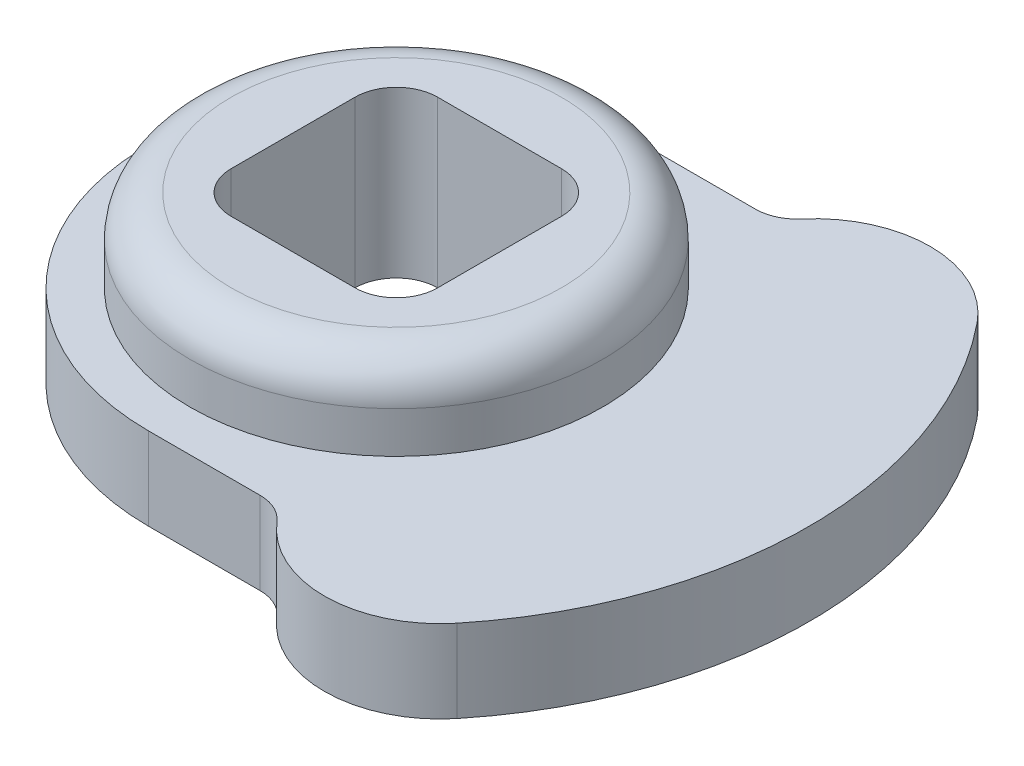
ISO-10303-21;
HEADER;
FILE_DESCRIPTION(('STEP AP214'),'2;1');
FILE_NAME('part.step','',(''),(''),'','','');
FILE_SCHEMA(('AUTOMOTIVE_DESIGN { 1 0 10303 214 1 1 1 1 }'));
ENDSEC;
DATA;
#1=APPLICATION_CONTEXT('core data for automotive mechanical design processes');
#2=APPLICATION_PROTOCOL_DEFINITION('international standard','automotive_design',2000,#1);
#3=PRODUCT_CONTEXT('',#1,'mechanical');
#4=PRODUCT('Part','Part','',(#3));
#5=PRODUCT_RELATED_PRODUCT_CATEGORY('part','',(#4));
#6=PRODUCT_DEFINITION_FORMATION('','',#4);
#7=PRODUCT_DEFINITION_CONTEXT('part definition',#1,'design');
#8=PRODUCT_DEFINITION('design','',#6,#7);
#9=PRODUCT_DEFINITION_SHAPE('','',#8);
#10=(LENGTH_UNIT() NAMED_UNIT(*) SI_UNIT(.MILLI.,.METRE.));
#11=(NAMED_UNIT(*) PLANE_ANGLE_UNIT() SI_UNIT($,.RADIAN.));
#12=(NAMED_UNIT(*) SI_UNIT($,.STERADIAN.) SOLID_ANGLE_UNIT());
#13=UNCERTAINTY_MEASURE_WITH_UNIT(LENGTH_MEASURE(1.E-05),#10,'distance_accuracy_value','');
#14=(GEOMETRIC_REPRESENTATION_CONTEXT(3) GLOBAL_UNCERTAINTY_ASSIGNED_CONTEXT((#13)) GLOBAL_UNIT_ASSIGNED_CONTEXT((#10,
#11,#12)) REPRESENTATION_CONTEXT('',''));
#15=CARTESIAN_POINT('',(0.,0.,0.));
#16=DIRECTION('',(0.,0.,1.));
#17=DIRECTION('',(1.,0.,0.));
#18=AXIS2_PLACEMENT_3D('',#15,#16,#17);
#19=CARTESIAN_POINT('',(0.,5.08,0.));
#20=DIRECTION('',(0.,-1.,0.));
#21=DIRECTION('',(0.,0.,-1.));
#22=AXIS2_PLACEMENT_3D('',#19,#20,#21);
#23=CYLINDRICAL_SURFACE('',#22,6.35);
#24=CARTESIAN_POINT('',(0.,3.81,0.));
#25=DIRECTION('',(0.,1.,0.));
#26=DIRECTION('',(0.,0.,1.));
#27=AXIS2_PLACEMENT_3D('',#24,#25,#26);
#28=CIRCLE('',#27,6.35);
#29=CARTESIAN_POINT('',(0.,3.81,6.35));
#30=VERTEX_POINT('',#29);
#31=EDGE_CURVE('E11',#30,#30,#28,.F.);
#32=ORIENTED_EDGE('',*,*,#31,.T.);
#33=EDGE_LOOP('',(#32));
#34=FACE_BOUND('',#33,.T.);
#35=CARTESIAN_POINT('',(0.,2.54,0.));
#36=DIRECTION('',(0.,1.,0.));
#37=DIRECTION('',(0.,0.,1.));
#38=AXIS2_PLACEMENT_3D('',#35,#36,#37);
#39=CIRCLE('',#38,6.35);
#40=CARTESIAN_POINT('',(0.,2.54,6.35));
#41=VERTEX_POINT('',#40);
#42=EDGE_CURVE('E272',#41,#41,#39,.T.);
#43=ORIENTED_EDGE('',*,*,#42,.T.);
#44=EDGE_LOOP('',(#43));
#45=FACE_BOUND('',#44,.T.);
#46=ADVANCED_FACE('F33',(#34,#45),#23,.T.);
#47=CARTESIAN_POINT('',(0.,5.08,0.));
#48=DIRECTION('',(0.,1.,0.));
#49=DIRECTION('',(0.,0.,1.));
#50=AXIS2_PLACEMENT_3D('',#47,#48,#49);
#51=PLANE('',#50);
#52=CARTESIAN_POINT('',(0.,5.08,0.));
#53=DIRECTION('',(0.,1.,0.));
#54=DIRECTION('',(0.,0.,1.));
#55=AXIS2_PLACEMENT_3D('',#52,#53,#54);
#56=CIRCLE('',#55,5.08);
#57=CARTESIAN_POINT('',(0.,5.08,5.08));
#58=VERTEX_POINT('',#57);
#59=EDGE_CURVE('E41',#58,#58,#56,.T.);
#60=ORIENTED_EDGE('',*,*,#59,.T.);
#61=EDGE_LOOP('',(#60));
#62=FACE_BOUND('',#61,.T.);
#63=CARTESIAN_POINT('',(-1.905,5.08,1.905));
#64=DIRECTION('',(0.,1.,0.));
#65=DIRECTION('',(0.,0.,1.));
#66=AXIS2_PLACEMENT_3D('',#63,#64,#65);
#67=CIRCLE('',#66,1.27);
#68=CARTESIAN_POINT('',(-3.175,5.08,1.90499999999999));
#69=VERTEX_POINT('',#68);
#70=CARTESIAN_POINT('',(-1.90499999999999,5.08,3.175));
#71=VERTEX_POINT('',#70);
#72=EDGE_CURVE('E48',#69,#71,#67,.T.);
#73=ORIENTED_EDGE('',*,*,#72,.F.);
#74=DIRECTION('',(0.,0.,1.));
#75=VECTOR('',#74,1.);
#76=CARTESIAN_POINT('',(-3.175,5.08,-1.90499999999999));
#77=LINE('',#76,#75);
#78=CARTESIAN_POINT('',(-3.175,5.08,-1.90499999999999));
#79=VERTEX_POINT('',#78);
#80=EDGE_CURVE('E165',#79,#69,#77,.T.);
#81=ORIENTED_EDGE('',*,*,#80,.F.);
#82=CARTESIAN_POINT('',(-1.905,5.08,-1.905));
#83=DIRECTION('',(0.,1.,0.));
#84=DIRECTION('',(0.,0.,1.));
#85=AXIS2_PLACEMENT_3D('',#82,#83,#84);
#86=CIRCLE('',#85,1.27);
#87=CARTESIAN_POINT('',(-1.90499999999999,5.08,-3.175));
#88=VERTEX_POINT('',#87);
#89=EDGE_CURVE('E168',#88,#79,#86,.T.);
#90=ORIENTED_EDGE('',*,*,#89,.F.);
#91=DIRECTION('',(-1.,0.,0.));
#92=VECTOR('',#91,1.);
#93=CARTESIAN_POINT('',(-1.90499999999999,5.08,-3.175));
#94=LINE('',#93,#92);
#95=CARTESIAN_POINT('',(1.90499999999999,5.08,-3.175));
#96=VERTEX_POINT('',#95);
#97=EDGE_CURVE('E196',#96,#88,#94,.T.);
#98=ORIENTED_EDGE('',*,*,#97,.F.);
#99=CARTESIAN_POINT('',(1.905,5.08,-1.905));
#100=DIRECTION('',(0.,1.,0.));
#101=DIRECTION('',(0.,0.,1.));
#102=AXIS2_PLACEMENT_3D('',#99,#100,#101);
#103=CIRCLE('',#102,1.27);
#104=CARTESIAN_POINT('',(3.175,5.08,-1.90499999999999));
#105=VERTEX_POINT('',#104);
#106=EDGE_CURVE('E193',#105,#96,#103,.T.);
#107=ORIENTED_EDGE('',*,*,#106,.F.);
#108=DIRECTION('',(0.,0.,-1.));
#109=VECTOR('',#108,1.);
#110=CARTESIAN_POINT('',(3.175,5.08,-1.90499999999999));
#111=LINE('',#110,#109);
#112=CARTESIAN_POINT('',(3.175,5.08,1.90499999999999));
#113=VERTEX_POINT('',#112);
#114=EDGE_CURVE('E190',#113,#105,#111,.T.);
#115=ORIENTED_EDGE('',*,*,#114,.F.);
#116=CARTESIAN_POINT('',(1.905,5.08,1.905));
#117=DIRECTION('',(0.,1.,0.));
#118=DIRECTION('',(0.,0.,1.));
#119=AXIS2_PLACEMENT_3D('',#116,#117,#118);
#120=CIRCLE('',#119,1.27);
#121=CARTESIAN_POINT('',(1.90499999999999,5.08,3.175));
#122=VERTEX_POINT('',#121);
#123=EDGE_CURVE('E187',#122,#113,#120,.T.);
#124=ORIENTED_EDGE('',*,*,#123,.F.);
#125=DIRECTION('',(1.,0.,0.));
#126=VECTOR('',#125,1.);
#127=CARTESIAN_POINT('',(-1.90499999999999,5.08,3.175));
#128=LINE('',#127,#126);
#129=EDGE_CURVE('E185',#71,#122,#128,.T.);
#130=ORIENTED_EDGE('',*,*,#129,.F.);
#131=EDGE_LOOP('',(#73,#81,#90,#98,#107,#115,#124,#130));
#132=FACE_BOUND('',#131,.T.);
#133=ADVANCED_FACE('F277',(#62,#132),#51,.T.);
#134=CARTESIAN_POINT('',(0.,2.54,0.));
#135=DIRECTION('',(0.,-1.,0.));
#136=DIRECTION('',(0.,0.,-1.));
#137=AXIS2_PLACEMENT_3D('',#134,#135,#136);
#138=CYLINDRICAL_SURFACE('',#137,7.62);
#139=CARTESIAN_POINT('',(0.,0.,0.));
#140=DIRECTION('',(0.,1.,0.));
#141=DIRECTION('',(0.,0.,1.));
#142=AXIS2_PLACEMENT_3D('',#139,#140,#141);
#143=CIRCLE('',#142,7.62);
#144=CARTESIAN_POINT('',(0.,0.,-7.62));
#145=VERTEX_POINT('',#144);
#146=CARTESIAN_POINT('',(0.,0.,7.62));
#147=VERTEX_POINT('',#146);
#148=EDGE_CURVE('E203',#145,#147,#143,.T.);
#149=ORIENTED_EDGE('',*,*,#148,.T.);
#150=DIRECTION('',(0.,-1.,0.));
#151=VECTOR('',#150,1.);
#152=CARTESIAN_POINT('',(0.,2.54,7.62));
#153=LINE('',#152,#151);
#154=CARTESIAN_POINT('',(0.,2.54,7.62));
#155=VERTEX_POINT('',#154);
#156=EDGE_CURVE('E269',#155,#147,#153,.T.);
#157=ORIENTED_EDGE('',*,*,#156,.F.);
#158=CARTESIAN_POINT('',(0.,2.54,0.));
#159=DIRECTION('',(0.,1.,0.));
#160=DIRECTION('',(0.,0.,1.));
#161=AXIS2_PLACEMENT_3D('',#158,#159,#160);
#162=CIRCLE('',#161,7.62);
#163=CARTESIAN_POINT('',(0.,2.54,-7.62));
#164=VERTEX_POINT('',#163);
#165=EDGE_CURVE('E215',#164,#155,#162,.T.);
#166=ORIENTED_EDGE('',*,*,#165,.F.);
#167=DIRECTION('',(0.,-1.,0.));
#168=VECTOR('',#167,1.);
#169=CARTESIAN_POINT('',(0.,2.54,-7.62));
#170=LINE('',#169,#168);
#171=EDGE_CURVE('E233',#164,#145,#170,.T.);
#172=ORIENTED_EDGE('',*,*,#171,.T.);
#173=EDGE_LOOP('',(#149,#157,#166,#172));
#174=FACE_BOUND('',#173,.T.);
#175=ADVANCED_FACE('F293',(#174),#138,.T.);
#176=CARTESIAN_POINT('',(0.,2.54,7.62));
#177=DIRECTION('',(0.,0.,-1.));
#178=DIRECTION('',(-1.,0.,0.));
#179=AXIS2_PLACEMENT_3D('',#176,#177,#178);
#180=PLANE('',#179);
#181=DIRECTION('',(1.,0.,0.));
#182=VECTOR('',#181,1.);
#183=CARTESIAN_POINT('',(0.,0.,7.62));
#184=LINE('',#183,#182);
#185=CARTESIAN_POINT('',(3.429,0.,7.62));
#186=VERTEX_POINT('',#185);
#187=EDGE_CURVE('E236',#147,#186,#184,.T.);
#188=ORIENTED_EDGE('',*,*,#187,.T.);
#189=DIRECTION('',(0.,-1.,0.));
#190=VECTOR('',#189,1.);
#191=CARTESIAN_POINT('',(3.429,2.54,7.62));
#192=LINE('',#191,#190);
#193=CARTESIAN_POINT('',(3.429,2.54,7.62));
#194=VERTEX_POINT('',#193);
#195=EDGE_CURVE('E266',#194,#186,#192,.T.);
#196=ORIENTED_EDGE('',*,*,#195,.F.);
#197=DIRECTION('',(1.,0.,0.));
#198=VECTOR('',#197,1.);
#199=CARTESIAN_POINT('',(0.,2.54,7.62));
#200=LINE('',#199,#198);
#201=EDGE_CURVE('E218',#155,#194,#200,.T.);
#202=ORIENTED_EDGE('',*,*,#201,.F.);
#203=ORIENTED_EDGE('',*,*,#156,.T.);
#204=EDGE_LOOP('',(#188,#196,#202,#203));
#205=FACE_BOUND('',#204,.T.);
#206=ADVANCED_FACE('F302',(#205),#180,.F.);
#207=CARTESIAN_POINT('',(3.429,2.54,8.89));
#208=DIRECTION('',(0.,-1.,0.));
#209=DIRECTION('',(0.,0.,-1.));
#210=AXIS2_PLACEMENT_3D('',#207,#208,#209);
#211=CYLINDRICAL_SURFACE('',#210,1.27);
#212=CARTESIAN_POINT('',(3.429,0.,8.89));
#213=DIRECTION('',(0.,-1.,0.));
#214=DIRECTION('',(0.,0.,-1.));
#215=AXIS2_PLACEMENT_3D('',#212,#213,#214);
#216=CIRCLE('',#215,1.27);
#217=CARTESIAN_POINT('',(4.39559066854647,0.,8.0662266819817));
#218=VERTEX_POINT('',#217);
#219=EDGE_CURVE('E238',#186,#218,#216,.T.);
#220=ORIENTED_EDGE('',*,*,#219,.T.);
#221=DIRECTION('',(0.,-1.,0.));
#222=VECTOR('',#221,1.);
#223=CARTESIAN_POINT('',(4.39559066854647,2.54,8.0662266819817));
#224=LINE('',#223,#222);
#225=CARTESIAN_POINT('',(4.39559066854647,2.54,8.0662266819817));
#226=VERTEX_POINT('',#225);
#227=EDGE_CURVE('E263',#226,#218,#224,.T.);
#228=ORIENTED_EDGE('',*,*,#227,.F.);
#229=CARTESIAN_POINT('',(3.429,2.54,8.89));
#230=DIRECTION('',(0.,-1.,0.));
#231=DIRECTION('',(0.,0.,-1.));
#232=AXIS2_PLACEMENT_3D('',#229,#230,#231);
#233=CIRCLE('',#232,1.27);
#234=EDGE_CURVE('E221',#194,#226,#233,.T.);
#235=ORIENTED_EDGE('',*,*,#234,.F.);
#236=ORIENTED_EDGE('',*,*,#195,.T.);
#237=EDGE_LOOP('',(#220,#228,#235,#236));
#238=FACE_BOUND('',#237,.T.);
#239=ADVANCED_FACE('F306',(#238),#211,.F.);
#240=CARTESIAN_POINT('',(7.1020445404766,2.54,5.75966139153045));
#241=DIRECTION('',(0.,-1.,0.));
#242=DIRECTION('',(0.,0.,-1.));
#243=AXIS2_PLACEMENT_3D('',#240,#241,#242);
#244=CYLINDRICAL_SURFACE('',#243,3.556);
#245=CARTESIAN_POINT('',(7.1020445404766,0.,5.75966139153045));
#246=DIRECTION('',(0.,1.,0.));
#247=DIRECTION('',(0.,0.,1.));
#248=AXIS2_PLACEMENT_3D('',#245,#246,#247);
#249=CIRCLE('',#248,3.556);
#250=CARTESIAN_POINT('',(9.86395075066194,0.,7.99952971045897));
#251=VERTEX_POINT('',#250);
#252=EDGE_CURVE('E240',#218,#251,#249,.T.);
#253=ORIENTED_EDGE('',*,*,#252,.T.);
#254=DIRECTION('',(0.,-1.,0.));
#255=VECTOR('',#254,1.);
#256=CARTESIAN_POINT('',(9.86395075066194,2.54,7.99952971045897));
#257=LINE('',#256,#255);
#258=CARTESIAN_POINT('',(9.86395075066194,2.54,7.99952971045897));
#259=VERTEX_POINT('',#258);
#260=EDGE_CURVE('E260',#259,#251,#257,.T.);
#261=ORIENTED_EDGE('',*,*,#260,.F.);
#262=CARTESIAN_POINT('',(7.1020445404766,2.54,5.75966139153045));
#263=DIRECTION('',(0.,1.,0.));
#264=DIRECTION('',(0.,0.,1.));
#265=AXIS2_PLACEMENT_3D('',#262,#263,#264);
#266=CIRCLE('',#265,3.556);
#267=EDGE_CURVE('E223',#226,#259,#266,.T.);
#268=ORIENTED_EDGE('',*,*,#267,.F.);
#269=ORIENTED_EDGE('',*,*,#227,.T.);
#270=EDGE_LOOP('',(#253,#261,#268,#269));
#271=FACE_BOUND('',#270,.T.);
#272=ADVANCED_FACE('F310',(#271),#244,.T.);
#273=CARTESIAN_POINT('',(0.,2.54,0.));
#274=DIRECTION('',(0.,-1.,0.));
#275=DIRECTION('',(0.,0.,-1.));
#276=AXIS2_PLACEMENT_3D('',#273,#274,#275);
#277=CYLINDRICAL_SURFACE('',#276,12.7);
#278=CARTESIAN_POINT('',(0.,0.,0.));
#279=DIRECTION('',(0.,1.,0.));
#280=DIRECTION('',(0.,0.,-1.));
#281=AXIS2_PLACEMENT_3D('',#278,#279,#280);
#282=CIRCLE('',#281,12.7);
#283=CARTESIAN_POINT('',(9.86395075066194,0.,-7.99952971045896));
#284=VERTEX_POINT('',#283);
#285=EDGE_CURVE('E242',#251,#284,#282,.T.);
#286=ORIENTED_EDGE('',*,*,#285,.T.);
#287=DIRECTION('',(0.,-1.,0.));
#288=VECTOR('',#287,1.);
#289=CARTESIAN_POINT('',(9.86395075066194,2.54,-7.99952971045896));
#290=LINE('',#289,#288);
#291=CARTESIAN_POINT('',(9.86395075066194,2.54,-7.99952971045896));
#292=VERTEX_POINT('',#291);
#293=EDGE_CURVE('E257',#292,#284,#290,.T.);
#294=ORIENTED_EDGE('',*,*,#293,.F.);
#295=CARTESIAN_POINT('',(0.,2.54,0.));
#296=DIRECTION('',(0.,1.,0.));
#297=DIRECTION('',(0.,0.,-1.));
#298=AXIS2_PLACEMENT_3D('',#295,#296,#297);
#299=CIRCLE('',#298,12.7);
#300=EDGE_CURVE('E225',#259,#292,#299,.T.);
#301=ORIENTED_EDGE('',*,*,#300,.F.);
#302=ORIENTED_EDGE('',*,*,#260,.T.);
#303=EDGE_LOOP('',(#286,#294,#301,#302));
#304=FACE_BOUND('',#303,.T.);
#305=ADVANCED_FACE('F314',(#304),#277,.T.);
#306=CARTESIAN_POINT('',(7.1020445404766,2.54,-5.75966139153045));
#307=DIRECTION('',(0.,-1.,0.));
#308=DIRECTION('',(0.,0.,-1.));
#309=AXIS2_PLACEMENT_3D('',#306,#307,#308);
#310=CYLINDRICAL_SURFACE('',#309,3.556);
#311=CARTESIAN_POINT('',(7.1020445404766,0.,-5.75966139153045));
#312=DIRECTION('',(0.,1.,0.));
#313=DIRECTION('',(0.,0.,-1.));
#314=AXIS2_PLACEMENT_3D('',#311,#312,#313);
#315=CIRCLE('',#314,3.556);
#316=CARTESIAN_POINT('',(4.39559066854647,0.,-8.0662266819817));
#317=VERTEX_POINT('',#316);
#318=EDGE_CURVE('E244',#284,#317,#315,.T.);
#319=ORIENTED_EDGE('',*,*,#318,.T.);
#320=DIRECTION('',(0.,-1.,0.));
#321=VECTOR('',#320,1.);
#322=CARTESIAN_POINT('',(4.39559066854647,2.54,-8.0662266819817));
#323=LINE('',#322,#321);
#324=CARTESIAN_POINT('',(4.39559066854647,2.54,-8.0662266819817));
#325=VERTEX_POINT('',#324);
#326=EDGE_CURVE('E254',#325,#317,#323,.T.);
#327=ORIENTED_EDGE('',*,*,#326,.F.);
#328=CARTESIAN_POINT('',(7.1020445404766,2.54,-5.75966139153045));
#329=DIRECTION('',(0.,1.,0.));
#330=DIRECTION('',(0.,0.,-1.));
#331=AXIS2_PLACEMENT_3D('',#328,#329,#330);
#332=CIRCLE('',#331,3.556);
#333=EDGE_CURVE('E227',#292,#325,#332,.T.);
#334=ORIENTED_EDGE('',*,*,#333,.F.);
#335=ORIENTED_EDGE('',*,*,#293,.T.);
#336=EDGE_LOOP('',(#319,#327,#334,#335));
#337=FACE_BOUND('',#336,.T.);
#338=ADVANCED_FACE('F318',(#337),#310,.T.);
#339=CARTESIAN_POINT('',(3.429,2.54,-8.89));
#340=DIRECTION('',(0.,-1.,0.));
#341=DIRECTION('',(0.,0.,-1.));
#342=AXIS2_PLACEMENT_3D('',#339,#340,#341);
#343=CYLINDRICAL_SURFACE('',#342,1.27);
#344=CARTESIAN_POINT('',(3.429,0.,-8.89));
#345=DIRECTION('',(0.,-1.,0.));
#346=DIRECTION('',(0.,0.,1.));
#347=AXIS2_PLACEMENT_3D('',#344,#345,#346);
#348=CIRCLE('',#347,1.27);
#349=CARTESIAN_POINT('',(3.429,0.,-7.62));
#350=VERTEX_POINT('',#349);
#351=EDGE_CURVE('E246',#317,#350,#348,.T.);
#352=ORIENTED_EDGE('',*,*,#351,.T.);
#353=DIRECTION('',(0.,-1.,0.));
#354=VECTOR('',#353,1.);
#355=CARTESIAN_POINT('',(3.429,2.54,-7.62));
#356=LINE('',#355,#354);
#357=CARTESIAN_POINT('',(3.429,2.54,-7.62));
#358=VERTEX_POINT('',#357);
#359=EDGE_CURVE('E251',#358,#350,#356,.T.);
#360=ORIENTED_EDGE('',*,*,#359,.F.);
#361=CARTESIAN_POINT('',(3.429,2.54,-8.89));
#362=DIRECTION('',(0.,-1.,0.));
#363=DIRECTION('',(0.,0.,1.));
#364=AXIS2_PLACEMENT_3D('',#361,#362,#363);
#365=CIRCLE('',#364,1.27);
#366=EDGE_CURVE('E229',#325,#358,#365,.T.);
#367=ORIENTED_EDGE('',*,*,#366,.F.);
#368=ORIENTED_EDGE('',*,*,#326,.T.);
#369=EDGE_LOOP('',(#352,#360,#367,#368));
#370=FACE_BOUND('',#369,.T.);
#371=ADVANCED_FACE('F322',(#370),#343,.F.);
#372=CARTESIAN_POINT('',(0.,2.54,-7.62));
#373=DIRECTION('',(0.,0.,1.));
#374=DIRECTION('',(1.,0.,0.));
#375=AXIS2_PLACEMENT_3D('',#372,#373,#374);
#376=PLANE('',#375);
#377=DIRECTION('',(-1.,0.,0.));
#378=VECTOR('',#377,1.);
#379=CARTESIAN_POINT('',(0.,0.,-7.62));
#380=LINE('',#379,#378);
#381=EDGE_CURVE('E219',#350,#145,#380,.T.);
#382=ORIENTED_EDGE('',*,*,#381,.T.);
#383=ORIENTED_EDGE('',*,*,#171,.F.);
#384=DIRECTION('',(-1.,0.,0.));
#385=VECTOR('',#384,1.);
#386=CARTESIAN_POINT('',(0.,2.54,-7.62));
#387=LINE('',#386,#385);
#388=EDGE_CURVE('E231',#358,#164,#387,.T.);
#389=ORIENTED_EDGE('',*,*,#388,.F.);
#390=ORIENTED_EDGE('',*,*,#359,.T.);
#391=EDGE_LOOP('',(#382,#383,#389,#390));
#392=FACE_BOUND('',#391,.T.);
#393=ADVANCED_FACE('F326',(#392),#376,.F.);
#394=CARTESIAN_POINT('',(0.,2.54,0.));
#395=DIRECTION('',(0.,1.,0.));
#396=DIRECTION('',(0.,0.,1.));
#397=AXIS2_PLACEMENT_3D('',#394,#395,#396);
#398=PLANE('',#397);
#399=ORIENTED_EDGE('',*,*,#42,.F.);
#400=EDGE_LOOP('',(#399));
#401=FACE_BOUND('',#400,.T.);
#402=ORIENTED_EDGE('',*,*,#165,.T.);
#403=ORIENTED_EDGE('',*,*,#201,.T.);
#404=ORIENTED_EDGE('',*,*,#234,.T.);
#405=ORIENTED_EDGE('',*,*,#267,.T.);
#406=ORIENTED_EDGE('',*,*,#300,.T.);
#407=ORIENTED_EDGE('',*,*,#333,.T.);
#408=ORIENTED_EDGE('',*,*,#366,.T.);
#409=ORIENTED_EDGE('',*,*,#388,.T.);
#410=EDGE_LOOP('',(#402,#403,#404,#405,#406,#407,#408,#409));
#411=FACE_BOUND('',#410,.T.);
#412=ADVANCED_FACE('F298',(#401,#411),#398,.T.);
#413=CARTESIAN_POINT('',(0.,0.,0.));
#414=DIRECTION('',(0.,1.,0.));
#415=DIRECTION('',(0.,0.,1.));
#416=AXIS2_PLACEMENT_3D('',#413,#414,#415);
#417=PLANE('',#416);
#418=DIRECTION('',(0.,0.,1.));
#419=VECTOR('',#418,1.);
#420=CARTESIAN_POINT('',(-3.175,0.,-1.90499999999999));
#421=LINE('',#420,#419);
#422=CARTESIAN_POINT('',(-3.175,0.,-1.90499999999999));
#423=VERTEX_POINT('',#422);
#424=CARTESIAN_POINT('',(-3.175,0.,1.90499999999999));
#425=VERTEX_POINT('',#424);
#426=EDGE_CURVE('E154',#423,#425,#421,.T.);
#427=ORIENTED_EDGE('',*,*,#426,.T.);
#428=CARTESIAN_POINT('',(-1.905,0.,1.905));
#429=DIRECTION('',(0.,1.,0.));
#430=DIRECTION('',(0.,0.,1.));
#431=AXIS2_PLACEMENT_3D('',#428,#429,#430);
#432=CIRCLE('',#431,1.27);
#433=CARTESIAN_POINT('',(-1.90499999999999,0.,3.175));
#434=VERTEX_POINT('',#433);
#435=EDGE_CURVE('E148',#425,#434,#432,.T.);
#436=ORIENTED_EDGE('',*,*,#435,.T.);
#437=DIRECTION('',(1.,0.,0.));
#438=VECTOR('',#437,1.);
#439=CARTESIAN_POINT('',(-1.90499999999999,0.,3.175));
#440=LINE('',#439,#438);
#441=CARTESIAN_POINT('',(1.90499999999999,0.,3.175));
#442=VERTEX_POINT('',#441);
#443=EDGE_CURVE('E157',#434,#442,#440,.T.);
#444=ORIENTED_EDGE('',*,*,#443,.T.);
#445=CARTESIAN_POINT('',(1.905,0.,1.905));
#446=DIRECTION('',(0.,1.,0.));
#447=DIRECTION('',(0.,0.,1.));
#448=AXIS2_PLACEMENT_3D('',#445,#446,#447);
#449=CIRCLE('',#448,1.27);
#450=CARTESIAN_POINT('',(3.175,0.,1.90499999999999));
#451=VERTEX_POINT('',#450);
#452=EDGE_CURVE('E56',#442,#451,#449,.T.);
#453=ORIENTED_EDGE('',*,*,#452,.T.);
#454=DIRECTION('',(0.,0.,-1.));
#455=VECTOR('',#454,1.);
#456=CARTESIAN_POINT('',(3.175,0.,-1.90499999999999));
#457=LINE('',#456,#455);
#458=CARTESIAN_POINT('',(3.175,0.,-1.90499999999999));
#459=VERTEX_POINT('',#458);
#460=EDGE_CURVE('E172',#451,#459,#457,.T.);
#461=ORIENTED_EDGE('',*,*,#460,.T.);
#462=CARTESIAN_POINT('',(1.905,0.,-1.905));
#463=DIRECTION('',(0.,1.,0.));
#464=DIRECTION('',(0.,0.,1.));
#465=AXIS2_PLACEMENT_3D('',#462,#463,#464);
#466=CIRCLE('',#465,1.27);
#467=CARTESIAN_POINT('',(1.90499999999999,0.,-3.175));
#468=VERTEX_POINT('',#467);
#469=EDGE_CURVE('E175',#459,#468,#466,.T.);
#470=ORIENTED_EDGE('',*,*,#469,.T.);
#471=DIRECTION('',(-1.,0.,0.));
#472=VECTOR('',#471,1.);
#473=CARTESIAN_POINT('',(-1.90499999999999,0.,-3.175));
#474=LINE('',#473,#472);
#475=CARTESIAN_POINT('',(-1.90499999999999,0.,-3.175));
#476=VERTEX_POINT('',#475);
#477=EDGE_CURVE('E178',#468,#476,#474,.T.);
#478=ORIENTED_EDGE('',*,*,#477,.T.);
#479=CARTESIAN_POINT('',(-1.905,0.,-1.905));
#480=DIRECTION('',(0.,1.,0.));
#481=DIRECTION('',(0.,0.,1.));
#482=AXIS2_PLACEMENT_3D('',#479,#480,#481);
#483=CIRCLE('',#482,1.27);
#484=EDGE_CURVE('E181',#476,#423,#483,.T.);
#485=ORIENTED_EDGE('',*,*,#484,.T.);
#486=EDGE_LOOP('',(#427,#436,#444,#453,#461,#470,#478,#485));
#487=FACE_BOUND('',#486,.T.);
#488=ORIENTED_EDGE('',*,*,#148,.F.);
#489=ORIENTED_EDGE('',*,*,#381,.F.);
#490=ORIENTED_EDGE('',*,*,#351,.F.);
#491=ORIENTED_EDGE('',*,*,#318,.F.);
#492=ORIENTED_EDGE('',*,*,#285,.F.);
#493=ORIENTED_EDGE('',*,*,#252,.F.);
#494=ORIENTED_EDGE('',*,*,#219,.F.);
#495=ORIENTED_EDGE('',*,*,#187,.F.);
#496=EDGE_LOOP('',(#488,#489,#490,#491,#492,#493,#494,#495));
#497=FACE_BOUND('',#496,.T.);
#498=ADVANCED_FACE('F161',(#487,#497),#417,.F.);
#499=CARTESIAN_POINT('',(-1.905,0.,1.905));
#500=DIRECTION('',(0.,1.,0.));
#501=DIRECTION('',(0.,0.,1.));
#502=AXIS2_PLACEMENT_3D('',#499,#500,#501);
#503=CYLINDRICAL_SURFACE('',#502,1.27);
#504=ORIENTED_EDGE('',*,*,#72,.T.);
#505=DIRECTION('',(0.,1.,0.));
#506=VECTOR('',#505,1.);
#507=CARTESIAN_POINT('',(-1.90499999999999,0.,3.175));
#508=LINE('',#507,#506);
#509=EDGE_CURVE('E144',#434,#71,#508,.T.);
#510=ORIENTED_EDGE('',*,*,#509,.F.);
#511=ORIENTED_EDGE('',*,*,#435,.F.);
#512=DIRECTION('',(0.,1.,0.));
#513=VECTOR('',#512,1.);
#514=CARTESIAN_POINT('',(-3.175,0.,1.90499999999999));
#515=LINE('',#514,#513);
#516=EDGE_CURVE('E201',#425,#69,#515,.T.);
#517=ORIENTED_EDGE('',*,*,#516,.T.);
#518=EDGE_LOOP('',(#504,#510,#511,#517));
#519=FACE_BOUND('',#518,.T.);
#520=ADVANCED_FACE('F146',(#519),#503,.F.);
#521=CARTESIAN_POINT('',(-3.175,0.,-1.90499999999999));
#522=DIRECTION('',(-1.,0.,0.));
#523=DIRECTION('',(0.,0.,1.));
#524=AXIS2_PLACEMENT_3D('',#521,#522,#523);
#525=PLANE('',#524);
#526=ORIENTED_EDGE('',*,*,#80,.T.);
#527=ORIENTED_EDGE('',*,*,#516,.F.);
#528=ORIENTED_EDGE('',*,*,#426,.F.);
#529=DIRECTION('',(0.,1.,0.));
#530=VECTOR('',#529,1.);
#531=CARTESIAN_POINT('',(-3.175,0.,-1.90499999999999));
#532=LINE('',#531,#530);
#533=EDGE_CURVE('E204',#423,#79,#532,.T.);
#534=ORIENTED_EDGE('',*,*,#533,.T.);
#535=EDGE_LOOP('',(#526,#527,#528,#534));
#536=FACE_BOUND('',#535,.T.);
#537=ADVANCED_FACE('F335',(#536),#525,.F.);
#538=CARTESIAN_POINT('',(-1.905,0.,-1.905));
#539=DIRECTION('',(0.,1.,0.));
#540=DIRECTION('',(0.,0.,1.));
#541=AXIS2_PLACEMENT_3D('',#538,#539,#540);
#542=CYLINDRICAL_SURFACE('',#541,1.27);
#543=ORIENTED_EDGE('',*,*,#89,.T.);
#544=ORIENTED_EDGE('',*,*,#533,.F.);
#545=ORIENTED_EDGE('',*,*,#484,.F.);
#546=DIRECTION('',(0.,1.,0.));
#547=VECTOR('',#546,1.);
#548=CARTESIAN_POINT('',(-1.90499999999999,0.,-3.175));
#549=LINE('',#548,#547);
#550=EDGE_CURVE('E206',#476,#88,#549,.T.);
#551=ORIENTED_EDGE('',*,*,#550,.T.);
#552=EDGE_LOOP('',(#543,#544,#545,#551));
#553=FACE_BOUND('',#552,.T.);
#554=ADVANCED_FACE('F350',(#553),#542,.F.);
#555=CARTESIAN_POINT('',(-1.90499999999999,0.,-3.175));
#556=DIRECTION('',(0.,0.,-1.));
#557=DIRECTION('',(-1.,0.,0.));
#558=AXIS2_PLACEMENT_3D('',#555,#556,#557);
#559=PLANE('',#558);
#560=ORIENTED_EDGE('',*,*,#97,.T.);
#561=ORIENTED_EDGE('',*,*,#550,.F.);
#562=ORIENTED_EDGE('',*,*,#477,.F.);
#563=DIRECTION('',(0.,1.,0.));
#564=VECTOR('',#563,1.);
#565=CARTESIAN_POINT('',(1.90499999999999,0.,-3.175));
#566=LINE('',#565,#564);
#567=EDGE_CURVE('E208',#468,#96,#566,.T.);
#568=ORIENTED_EDGE('',*,*,#567,.T.);
#569=EDGE_LOOP('',(#560,#561,#562,#568));
#570=FACE_BOUND('',#569,.T.);
#571=ADVANCED_FACE('F346',(#570),#559,.F.);
#572=CARTESIAN_POINT('',(1.905,0.,-1.905));
#573=DIRECTION('',(0.,1.,0.));
#574=DIRECTION('',(0.,0.,1.));
#575=AXIS2_PLACEMENT_3D('',#572,#573,#574);
#576=CYLINDRICAL_SURFACE('',#575,1.27);
#577=ORIENTED_EDGE('',*,*,#106,.T.);
#578=ORIENTED_EDGE('',*,*,#567,.F.);
#579=ORIENTED_EDGE('',*,*,#469,.F.);
#580=DIRECTION('',(0.,1.,0.));
#581=VECTOR('',#580,1.);
#582=CARTESIAN_POINT('',(3.175,0.,-1.90499999999999));
#583=LINE('',#582,#581);
#584=EDGE_CURVE('E210',#459,#105,#583,.T.);
#585=ORIENTED_EDGE('',*,*,#584,.T.);
#586=EDGE_LOOP('',(#577,#578,#579,#585));
#587=FACE_BOUND('',#586,.T.);
#588=ADVANCED_FACE('F342',(#587),#576,.F.);
#589=CARTESIAN_POINT('',(3.175,0.,-1.90499999999999));
#590=DIRECTION('',(1.,0.,0.));
#591=DIRECTION('',(0.,0.,-1.));
#592=AXIS2_PLACEMENT_3D('',#589,#590,#591);
#593=PLANE('',#592);
#594=ORIENTED_EDGE('',*,*,#114,.T.);
#595=ORIENTED_EDGE('',*,*,#584,.F.);
#596=ORIENTED_EDGE('',*,*,#460,.F.);
#597=DIRECTION('',(0.,1.,0.));
#598=VECTOR('',#597,1.);
#599=CARTESIAN_POINT('',(3.175,0.,1.90499999999999));
#600=LINE('',#599,#598);
#601=EDGE_CURVE('E212',#451,#113,#600,.T.);
#602=ORIENTED_EDGE('',*,*,#601,.T.);
#603=EDGE_LOOP('',(#594,#595,#596,#602));
#604=FACE_BOUND('',#603,.T.);
#605=ADVANCED_FACE('F339',(#604),#593,.F.);
#606=CARTESIAN_POINT('',(1.905,0.,1.905));
#607=DIRECTION('',(0.,1.,0.));
#608=DIRECTION('',(0.,0.,1.));
#609=AXIS2_PLACEMENT_3D('',#606,#607,#608);
#610=CYLINDRICAL_SURFACE('',#609,1.27);
#611=ORIENTED_EDGE('',*,*,#123,.T.);
#612=ORIENTED_EDGE('',*,*,#601,.F.);
#613=ORIENTED_EDGE('',*,*,#452,.F.);
#614=DIRECTION('',(0.,1.,0.));
#615=VECTOR('',#614,1.);
#616=CARTESIAN_POINT('',(1.90499999999999,0.,3.175));
#617=LINE('',#616,#615);
#618=EDGE_CURVE('E153',#442,#122,#617,.T.);
#619=ORIENTED_EDGE('',*,*,#618,.T.);
#620=EDGE_LOOP('',(#611,#612,#613,#619));
#621=FACE_BOUND('',#620,.T.);
#622=ADVANCED_FACE('F285',(#621),#610,.F.);
#623=CARTESIAN_POINT('',(-1.90499999999999,0.,3.175));
#624=DIRECTION('',(0.,0.,1.));
#625=DIRECTION('',(1.,0.,0.));
#626=AXIS2_PLACEMENT_3D('',#623,#624,#625);
#627=PLANE('',#626);
#628=ORIENTED_EDGE('',*,*,#129,.T.);
#629=ORIENTED_EDGE('',*,*,#618,.F.);
#630=ORIENTED_EDGE('',*,*,#443,.F.);
#631=ORIENTED_EDGE('',*,*,#509,.T.);
#632=EDGE_LOOP('',(#628,#629,#630,#631));
#633=FACE_BOUND('',#632,.T.);
#634=ADVANCED_FACE('F158',(#633),#627,.F.);
#635=CARTESIAN_POINT('',(0.,3.81,0.));
#636=DIRECTION('',(0.,1.,0.));
#637=DIRECTION('',(0.,0.,1.));
#638=AXIS2_PLACEMENT_3D('',#635,#636,#637);
#639=TOROIDAL_SURFACE('',#638,5.08,1.27);
#640=ORIENTED_EDGE('',*,*,#31,.F.);
#641=EDGE_LOOP('',(#640));
#642=FACE_BOUND('',#641,.T.);
#643=ORIENTED_EDGE('',*,*,#59,.F.);
#644=EDGE_LOOP('',(#643));
#645=FACE_BOUND('',#644,.T.);
#646=ADVANCED_FACE('F35',(#642,#645),#639,.T.);
#647=CLOSED_SHELL('',(#46,#133,#175,#206,#239,#272,#305,#338,#371,#393,#412,#498,#520,#537,#554,
#571,#588,#605,#622,#634,#646));
#648=MANIFOLD_SOLID_BREP('B2',#647);
#649=ADVANCED_BREP_SHAPE_REPRESENTATION('',(#18,#648),#14);
#650=SHAPE_DEFINITION_REPRESENTATION(#9,#649);
ENDSEC;
END-ISO-10303-21;
